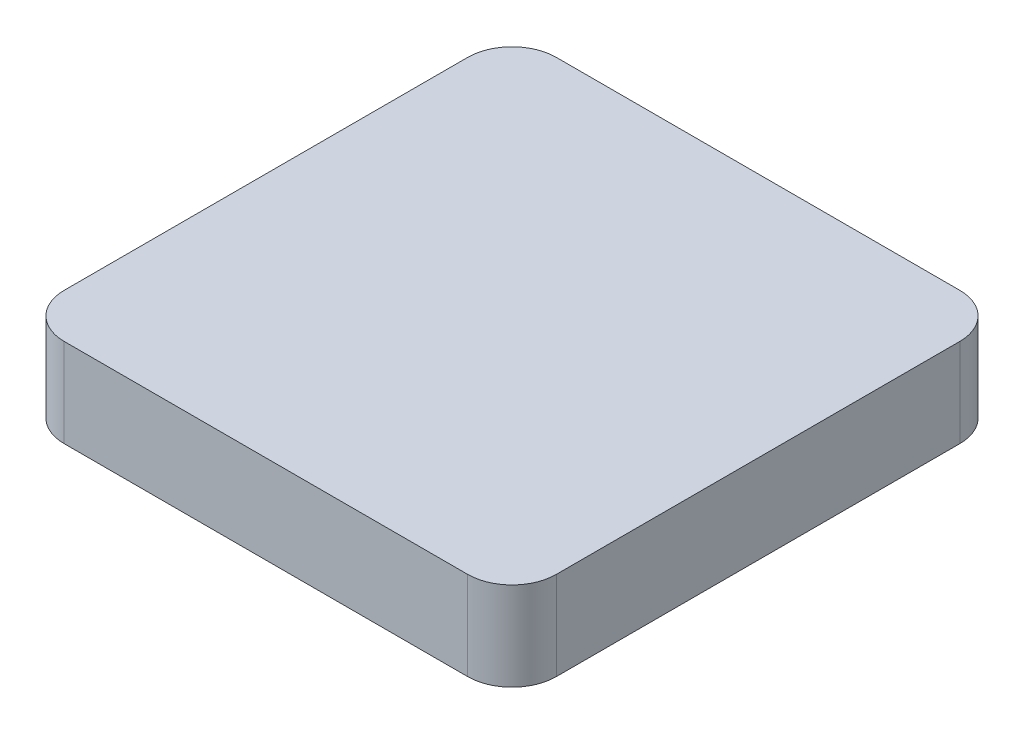
ISO-10303-21;
HEADER;
FILE_DESCRIPTION(('STEP AP214'),'2;1');
FILE_NAME('part.step','',(''),(''),'','','');
FILE_SCHEMA(('AUTOMOTIVE_DESIGN { 1 0 10303 214 1 1 1 1 }'));
ENDSEC;
DATA;
#1=APPLICATION_CONTEXT('core data for automotive mechanical design processes');
#2=APPLICATION_PROTOCOL_DEFINITION('international standard','automotive_design',2000,#1);
#3=PRODUCT_CONTEXT('',#1,'mechanical');
#4=PRODUCT('Part','Part','',(#3));
#5=PRODUCT_RELATED_PRODUCT_CATEGORY('part','',(#4));
#6=PRODUCT_DEFINITION_FORMATION('','',#4);
#7=PRODUCT_DEFINITION_CONTEXT('part definition',#1,'design');
#8=PRODUCT_DEFINITION('design','',#6,#7);
#9=PRODUCT_DEFINITION_SHAPE('','',#8);
#10=(LENGTH_UNIT() NAMED_UNIT(*) SI_UNIT(.MILLI.,.METRE.));
#11=(NAMED_UNIT(*) PLANE_ANGLE_UNIT() SI_UNIT($,.RADIAN.));
#12=(NAMED_UNIT(*) SI_UNIT($,.STERADIAN.) SOLID_ANGLE_UNIT());
#13=UNCERTAINTY_MEASURE_WITH_UNIT(LENGTH_MEASURE(1.E-05),#10,'distance_accuracy_value','');
#14=(GEOMETRIC_REPRESENTATION_CONTEXT(3) GLOBAL_UNCERTAINTY_ASSIGNED_CONTEXT((#13)) GLOBAL_UNIT_ASSIGNED_CONTEXT((#10,
#11,#12)) REPRESENTATION_CONTEXT('',''));
#15=CARTESIAN_POINT('',(0.,0.,0.));
#16=DIRECTION('',(0.,0.,1.));
#17=DIRECTION('',(1.,0.,0.));
#18=AXIS2_PLACEMENT_3D('',#15,#16,#17);
#19=CARTESIAN_POINT('',(-108.333333333333,25.5,108.333333333333));
#20=DIRECTION('',(1.,0.,0.));
#21=DIRECTION('',(0.,0.,-1.));
#22=AXIS2_PLACEMENT_3D('',#19,#20,#21);
#23=PLANE('',#22);
#24=DIRECTION('',(0.,0.,1.));
#25=VECTOR('',#24,1.);
#26=CARTESIAN_POINT('',(-108.333333333333,25.5,108.333333333333));
#27=LINE('',#26,#25);
#28=CARTESIAN_POINT('',(-108.333333333333,25.5,-119.166666666667));
#29=VERTEX_POINT('',#28);
#30=CARTESIAN_POINT('',(-108.333333333333,25.5,85.8333333333333));
#31=VERTEX_POINT('',#30);
#32=EDGE_CURVE('E125',#29,#31,#27,.T.);
#33=ORIENTED_EDGE('',*,*,#32,.F.);
#34=DIRECTION('',(0.,-1.,0.));
#35=VECTOR('',#34,1.);
#36=CARTESIAN_POINT('',(-108.333333333333,25.5,-119.166666666667));
#37=LINE('',#36,#35);
#38=CARTESIAN_POINT('',(-108.333333333333,-19.5,-119.166666666667));
#39=VERTEX_POINT('',#38);
#40=EDGE_CURVE('E110',#29,#39,#37,.T.);
#41=ORIENTED_EDGE('',*,*,#40,.T.);
#42=DIRECTION('',(0.,0.,1.));
#43=VECTOR('',#42,1.);
#44=CARTESIAN_POINT('',(-108.333333333333,-19.5,108.333333333333));
#45=LINE('',#44,#43);
#46=CARTESIAN_POINT('',(-108.333333333333,-19.5,85.8333333333333));
#47=VERTEX_POINT('',#46);
#48=EDGE_CURVE('E122',#39,#47,#45,.T.);
#49=ORIENTED_EDGE('',*,*,#48,.T.);
#50=DIRECTION('',(0.,-1.,0.));
#51=VECTOR('',#50,1.);
#52=CARTESIAN_POINT('',(-108.333333333333,25.5,85.8333333333333));
#53=LINE('',#52,#51);
#54=EDGE_CURVE('E127',#47,#31,#53,.F.);
#55=ORIENTED_EDGE('',*,*,#54,.T.);
#56=EDGE_LOOP('',(#33,#41,#49,#55));
#57=FACE_BOUND('',#56,.T.);
#58=ADVANCED_FACE('F39',(#57),#23,.F.);
#59=CARTESIAN_POINT('',(-108.333333333333,25.5,108.333333333333));
#60=DIRECTION('',(0.,0.,-1.));
#61=DIRECTION('',(-1.,0.,0.));
#62=AXIS2_PLACEMENT_3D('',#59,#60,#61);
#63=PLANE('',#62);
#64=DIRECTION('',(1.,0.,0.));
#65=VECTOR('',#64,1.);
#66=CARTESIAN_POINT('',(-108.333333333333,25.5,108.333333333333));
#67=LINE('',#66,#65);
#68=CARTESIAN_POINT('',(-85.8333333333333,25.5,108.333333333333));
#69=VERTEX_POINT('',#68);
#70=CARTESIAN_POINT('',(119.166666666667,25.5,108.333333333333));
#71=VERTEX_POINT('',#70);
#72=EDGE_CURVE('E165',#69,#71,#67,.T.);
#73=ORIENTED_EDGE('',*,*,#72,.F.);
#74=DIRECTION('',(0.,-1.,0.));
#75=VECTOR('',#74,1.);
#76=CARTESIAN_POINT('',(-85.8333333333333,25.5,108.333333333333));
#77=LINE('',#76,#75);
#78=CARTESIAN_POINT('',(-85.8333333333333,-19.5,108.333333333333));
#79=VERTEX_POINT('',#78);
#80=EDGE_CURVE('E11',#69,#79,#77,.T.);
#81=ORIENTED_EDGE('',*,*,#80,.T.);
#82=DIRECTION('',(1.,0.,0.));
#83=VECTOR('',#82,1.);
#84=CARTESIAN_POINT('',(-108.333333333333,-19.5,108.333333333333));
#85=LINE('',#84,#83);
#86=CARTESIAN_POINT('',(119.166666666667,-19.5,108.333333333333));
#87=VERTEX_POINT('',#86);
#88=EDGE_CURVE('E132',#79,#87,#85,.T.);
#89=ORIENTED_EDGE('',*,*,#88,.T.);
#90=DIRECTION('',(0.,-1.,0.));
#91=VECTOR('',#90,1.);
#92=CARTESIAN_POINT('',(119.166666666667,25.5,108.333333333333));
#93=LINE('',#92,#91);
#94=EDGE_CURVE('E47',#87,#71,#93,.F.);
#95=ORIENTED_EDGE('',*,*,#94,.T.);
#96=EDGE_LOOP('',(#73,#81,#89,#95));
#97=FACE_BOUND('',#96,.T.);
#98=ADVANCED_FACE('F164',(#97),#63,.F.);
#99=CARTESIAN_POINT('',(141.666666666667,25.5,108.333333333333));
#100=DIRECTION('',(-1.,0.,0.));
#101=DIRECTION('',(0.,0.,1.));
#102=AXIS2_PLACEMENT_3D('',#99,#100,#101);
#103=PLANE('',#102);
#104=DIRECTION('',(0.,0.,-1.));
#105=VECTOR('',#104,1.);
#106=CARTESIAN_POINT('',(141.666666666667,-19.5,108.333333333333));
#107=LINE('',#106,#105);
#108=CARTESIAN_POINT('',(141.666666666667,-19.5,85.8333333333333));
#109=VERTEX_POINT('',#108);
#110=CARTESIAN_POINT('',(141.666666666667,-19.5,-119.166666666667));
#111=VERTEX_POINT('',#110);
#112=EDGE_CURVE('E135',#109,#111,#107,.T.);
#113=ORIENTED_EDGE('',*,*,#112,.T.);
#114=DIRECTION('',(0.,-1.,0.));
#115=VECTOR('',#114,1.);
#116=CARTESIAN_POINT('',(141.666666666667,25.5,-119.166666666667));
#117=LINE('',#116,#115);
#118=CARTESIAN_POINT('',(141.666666666667,25.5,-119.166666666667));
#119=VERTEX_POINT('',#118);
#120=EDGE_CURVE('E54',#111,#119,#117,.F.);
#121=ORIENTED_EDGE('',*,*,#120,.T.);
#122=DIRECTION('',(0.,0.,-1.));
#123=VECTOR('',#122,1.);
#124=CARTESIAN_POINT('',(141.666666666667,25.5,108.333333333333));
#125=LINE('',#124,#123);
#126=CARTESIAN_POINT('',(141.666666666667,25.5,85.8333333333333));
#127=VERTEX_POINT('',#126);
#128=EDGE_CURVE('E171',#127,#119,#125,.T.);
#129=ORIENTED_EDGE('',*,*,#128,.F.);
#130=DIRECTION('',(0.,-1.,0.));
#131=VECTOR('',#130,1.);
#132=CARTESIAN_POINT('',(141.666666666667,25.5,85.8333333333333));
#133=LINE('',#132,#131);
#134=EDGE_CURVE('E158',#127,#109,#133,.T.);
#135=ORIENTED_EDGE('',*,*,#134,.T.);
#136=EDGE_LOOP('',(#113,#121,#129,#135));
#137=FACE_BOUND('',#136,.T.);
#138=ADVANCED_FACE('F175',(#137),#103,.F.);
#139=CARTESIAN_POINT('',(-108.333333333333,25.5,-141.666666666667));
#140=DIRECTION('',(0.,0.,1.));
#141=DIRECTION('',(1.,0.,0.));
#142=AXIS2_PLACEMENT_3D('',#139,#140,#141);
#143=PLANE('',#142);
#144=DIRECTION('',(-1.,0.,0.));
#145=VECTOR('',#144,1.);
#146=CARTESIAN_POINT('',(-108.333333333333,-19.5,-141.666666666667));
#147=LINE('',#146,#145);
#148=CARTESIAN_POINT('',(119.166666666667,-19.5,-141.666666666667));
#149=VERTEX_POINT('',#148);
#150=CARTESIAN_POINT('',(-85.8333333333333,-19.5,-141.666666666667));
#151=VERTEX_POINT('',#150);
#152=EDGE_CURVE('E142',#149,#151,#147,.T.);
#153=ORIENTED_EDGE('',*,*,#152,.T.);
#154=DIRECTION('',(0.,-1.,0.));
#155=VECTOR('',#154,1.);
#156=CARTESIAN_POINT('',(-85.8333333333333,25.5,-141.666666666667));
#157=LINE('',#156,#155);
#158=CARTESIAN_POINT('',(-85.8333333333333,25.5,-141.666666666667));
#159=VERTEX_POINT('',#158);
#160=EDGE_CURVE('E111',#151,#159,#157,.F.);
#161=ORIENTED_EDGE('',*,*,#160,.T.);
#162=DIRECTION('',(-1.,0.,0.));
#163=VECTOR('',#162,1.);
#164=CARTESIAN_POINT('',(-108.333333333333,25.5,-141.666666666667));
#165=LINE('',#164,#163);
#166=CARTESIAN_POINT('',(119.166666666667,25.5,-141.666666666667));
#167=VERTEX_POINT('',#166);
#168=EDGE_CURVE('E138',#167,#159,#165,.T.);
#169=ORIENTED_EDGE('',*,*,#168,.F.);
#170=DIRECTION('',(0.,-1.,0.));
#171=VECTOR('',#170,1.);
#172=CARTESIAN_POINT('',(119.166666666667,25.5,-141.666666666667));
#173=LINE('',#172,#171);
#174=EDGE_CURVE('E116',#167,#149,#173,.T.);
#175=ORIENTED_EDGE('',*,*,#174,.T.);
#176=EDGE_LOOP('',(#153,#161,#169,#175));
#177=FACE_BOUND('',#176,.T.);
#178=ADVANCED_FACE('F182',(#177),#143,.F.);
#179=CARTESIAN_POINT('',(-108.333333333333,25.5,108.333333333333));
#180=DIRECTION('',(0.,-1.,0.));
#181=DIRECTION('',(0.,0.,-1.));
#182=AXIS2_PLACEMENT_3D('',#179,#180,#181);
#183=PLANE('',#182);
#184=ORIENTED_EDGE('',*,*,#168,.T.);
#185=CARTESIAN_POINT('',(-85.8333333333333,25.5,-119.166666666667));
#186=DIRECTION('',(0.,-1.,0.));
#187=DIRECTION('',(0.,0.,-1.));
#188=AXIS2_PLACEMENT_3D('',#185,#186,#187);
#189=CIRCLE('',#188,22.5);
#190=EDGE_CURVE('E156',#159,#29,#189,.F.);
#191=ORIENTED_EDGE('',*,*,#190,.T.);
#192=ORIENTED_EDGE('',*,*,#32,.T.);
#193=CARTESIAN_POINT('',(-85.8333333333333,25.5,85.8333333333333));
#194=DIRECTION('',(0.,-1.,0.));
#195=DIRECTION('',(0.,0.,-1.));
#196=AXIS2_PLACEMENT_3D('',#193,#194,#195);
#197=CIRCLE('',#196,22.5);
#198=EDGE_CURVE('E152',#31,#69,#197,.F.);
#199=ORIENTED_EDGE('',*,*,#198,.T.);
#200=ORIENTED_EDGE('',*,*,#72,.T.);
#201=CARTESIAN_POINT('',(119.166666666667,25.5,85.8333333333333));
#202=DIRECTION('',(0.,-1.,0.));
#203=DIRECTION('',(0.,0.,-1.));
#204=AXIS2_PLACEMENT_3D('',#201,#202,#203);
#205=CIRCLE('',#204,22.5);
#206=EDGE_CURVE('E61',#71,#127,#205,.F.);
#207=ORIENTED_EDGE('',*,*,#206,.T.);
#208=ORIENTED_EDGE('',*,*,#128,.T.);
#209=CARTESIAN_POINT('',(119.166666666667,25.5,-119.166666666667));
#210=DIRECTION('',(0.,-1.,0.));
#211=DIRECTION('',(0.,0.,-1.));
#212=AXIS2_PLACEMENT_3D('',#209,#210,#211);
#213=CIRCLE('',#212,22.5);
#214=EDGE_CURVE('E154',#119,#167,#213,.F.);
#215=ORIENTED_EDGE('',*,*,#214,.T.);
#216=EDGE_LOOP('',(#184,#191,#192,#199,#200,#207,#208,#215));
#217=FACE_BOUND('',#216,.T.);
#218=ADVANCED_FACE('F169',(#217),#183,.F.);
#219=CARTESIAN_POINT('',(-108.333333333333,-19.5,108.333333333333));
#220=DIRECTION('',(0.,-1.,0.));
#221=DIRECTION('',(0.,0.,-1.));
#222=AXIS2_PLACEMENT_3D('',#219,#220,#221);
#223=PLANE('',#222);
#224=ORIENTED_EDGE('',*,*,#48,.F.);
#225=CARTESIAN_POINT('',(-85.8333333333333,-19.5,-119.166666666667));
#226=DIRECTION('',(0.,-1.,0.));
#227=DIRECTION('',(0.,0.,-1.));
#228=AXIS2_PLACEMENT_3D('',#225,#226,#227);
#229=CIRCLE('',#228,22.5);
#230=EDGE_CURVE('E106',#39,#151,#229,.T.);
#231=ORIENTED_EDGE('',*,*,#230,.T.);
#232=ORIENTED_EDGE('',*,*,#152,.F.);
#233=CARTESIAN_POINT('',(119.166666666667,-19.5,-119.166666666667));
#234=DIRECTION('',(0.,-1.,0.));
#235=DIRECTION('',(0.,0.,-1.));
#236=AXIS2_PLACEMENT_3D('',#233,#234,#235);
#237=CIRCLE('',#236,22.5);
#238=EDGE_CURVE('E117',#149,#111,#237,.T.);
#239=ORIENTED_EDGE('',*,*,#238,.T.);
#240=ORIENTED_EDGE('',*,*,#112,.F.);
#241=CARTESIAN_POINT('',(119.166666666667,-19.5,85.8333333333333));
#242=DIRECTION('',(0.,-1.,0.));
#243=DIRECTION('',(0.,0.,-1.));
#244=AXIS2_PLACEMENT_3D('',#241,#242,#243);
#245=CIRCLE('',#244,22.5);
#246=EDGE_CURVE('E126',#109,#87,#245,.T.);
#247=ORIENTED_EDGE('',*,*,#246,.T.);
#248=ORIENTED_EDGE('',*,*,#88,.F.);
#249=CARTESIAN_POINT('',(-85.8333333333333,-19.5,85.8333333333333));
#250=DIRECTION('',(0.,-1.,0.));
#251=DIRECTION('',(0.,0.,-1.));
#252=AXIS2_PLACEMENT_3D('',#249,#250,#251);
#253=CIRCLE('',#252,22.5);
#254=EDGE_CURVE('E131',#79,#47,#253,.T.);
#255=ORIENTED_EDGE('',*,*,#254,.T.);
#256=EDGE_LOOP('',(#224,#231,#232,#239,#240,#247,#248,#255));
#257=FACE_BOUND('',#256,.T.);
#258=ADVANCED_FACE('F129',(#257),#223,.T.);
#259=CARTESIAN_POINT('',(-85.8333333333333,25.5,-119.166666666667));
#260=DIRECTION('',(0.,-1.,0.));
#261=DIRECTION('',(0.,0.,-1.));
#262=AXIS2_PLACEMENT_3D('',#259,#260,#261);
#263=CYLINDRICAL_SURFACE('',#262,22.5);
#264=ORIENTED_EDGE('',*,*,#190,.F.);
#265=ORIENTED_EDGE('',*,*,#160,.F.);
#266=ORIENTED_EDGE('',*,*,#230,.F.);
#267=ORIENTED_EDGE('',*,*,#40,.F.);
#268=EDGE_LOOP('',(#264,#265,#266,#267));
#269=FACE_BOUND('',#268,.T.);
#270=ADVANCED_FACE('F109',(#269),#263,.T.);
#271=CARTESIAN_POINT('',(119.166666666667,25.5,-119.166666666667));
#272=DIRECTION('',(0.,-1.,0.));
#273=DIRECTION('',(0.,0.,-1.));
#274=AXIS2_PLACEMENT_3D('',#271,#272,#273);
#275=CYLINDRICAL_SURFACE('',#274,22.5);
#276=ORIENTED_EDGE('',*,*,#214,.F.);
#277=ORIENTED_EDGE('',*,*,#120,.F.);
#278=ORIENTED_EDGE('',*,*,#238,.F.);
#279=ORIENTED_EDGE('',*,*,#174,.F.);
#280=EDGE_LOOP('',(#276,#277,#278,#279));
#281=FACE_BOUND('',#280,.T.);
#282=ADVANCED_FACE('F179',(#281),#275,.T.);
#283=CARTESIAN_POINT('',(-85.8333333333333,25.5,85.8333333333333));
#284=DIRECTION('',(0.,-1.,0.));
#285=DIRECTION('',(0.,0.,-1.));
#286=AXIS2_PLACEMENT_3D('',#283,#284,#285);
#287=CYLINDRICAL_SURFACE('',#286,22.5);
#288=ORIENTED_EDGE('',*,*,#198,.F.);
#289=ORIENTED_EDGE('',*,*,#54,.F.);
#290=ORIENTED_EDGE('',*,*,#254,.F.);
#291=ORIENTED_EDGE('',*,*,#80,.F.);
#292=EDGE_LOOP('',(#288,#289,#290,#291));
#293=FACE_BOUND('',#292,.T.);
#294=ADVANCED_FACE('F185',(#293),#287,.T.);
#295=CARTESIAN_POINT('',(119.166666666667,25.5,85.8333333333333));
#296=DIRECTION('',(0.,-1.,0.));
#297=DIRECTION('',(0.,0.,-1.));
#298=AXIS2_PLACEMENT_3D('',#295,#296,#297);
#299=CYLINDRICAL_SURFACE('',#298,22.5);
#300=ORIENTED_EDGE('',*,*,#206,.F.);
#301=ORIENTED_EDGE('',*,*,#94,.F.);
#302=ORIENTED_EDGE('',*,*,#246,.F.);
#303=ORIENTED_EDGE('',*,*,#134,.F.);
#304=EDGE_LOOP('',(#300,#301,#302,#303));
#305=FACE_BOUND('',#304,.T.);
#306=ADVANCED_FACE('F41',(#305),#299,.T.);
#307=CLOSED_SHELL('',(#58,#98,#138,#178,#218,#258,#270,#282,#294,#306));
#308=MANIFOLD_SOLID_BREP('B2',#307);
#309=ADVANCED_BREP_SHAPE_REPRESENTATION('',(#18,#308),#14);
#310=SHAPE_DEFINITION_REPRESENTATION(#9,#309);
ENDSEC;
END-ISO-10303-21;
